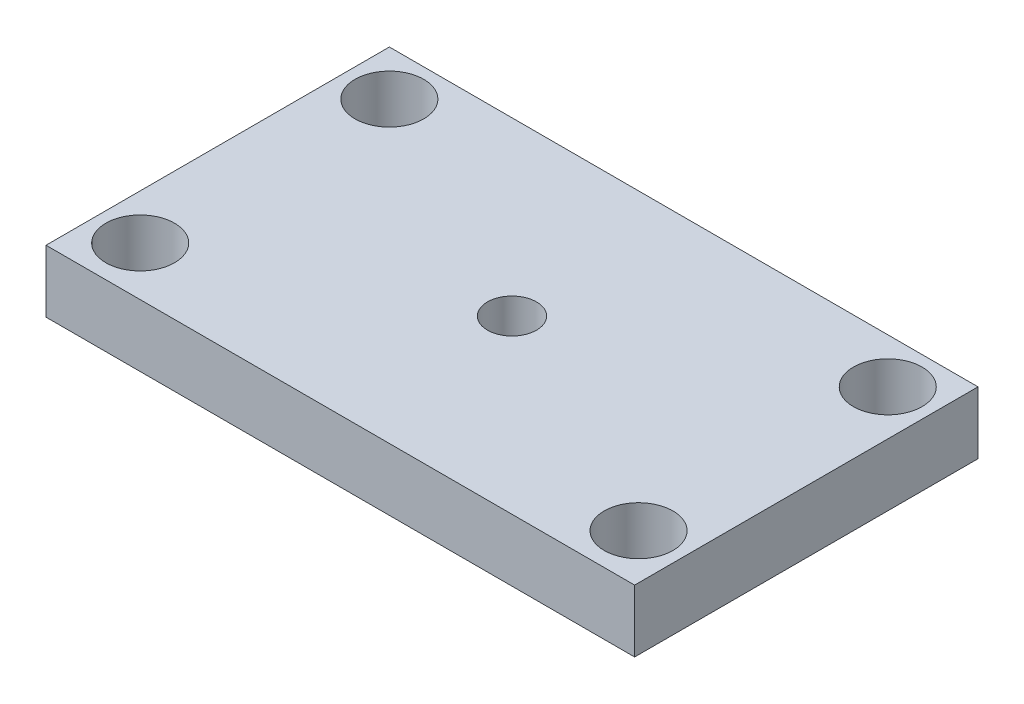
ISO-10303-21;
HEADER;
FILE_DESCRIPTION(('STEP AP214'),'2;1');
FILE_NAME('part.step','',(''),(''),'','','');
FILE_SCHEMA(('AUTOMOTIVE_DESIGN { 1 0 10303 214 1 1 1 1 }'));
ENDSEC;
DATA;
#1=APPLICATION_CONTEXT('core data for automotive mechanical design processes');
#2=APPLICATION_PROTOCOL_DEFINITION('international standard','automotive_design',2000,#1);
#3=PRODUCT_CONTEXT('',#1,'mechanical');
#4=PRODUCT('Part','Part','',(#3));
#5=PRODUCT_RELATED_PRODUCT_CATEGORY('part','',(#4));
#6=PRODUCT_DEFINITION_FORMATION('','',#4);
#7=PRODUCT_DEFINITION_CONTEXT('part definition',#1,'design');
#8=PRODUCT_DEFINITION('design','',#6,#7);
#9=PRODUCT_DEFINITION_SHAPE('','',#8);
#10=(LENGTH_UNIT() NAMED_UNIT(*) SI_UNIT(.MILLI.,.METRE.));
#11=(NAMED_UNIT(*) PLANE_ANGLE_UNIT() SI_UNIT($,.RADIAN.));
#12=(NAMED_UNIT(*) SI_UNIT($,.STERADIAN.) SOLID_ANGLE_UNIT());
#13=UNCERTAINTY_MEASURE_WITH_UNIT(LENGTH_MEASURE(1.E-05),#10,'distance_accuracy_value','');
#14=(GEOMETRIC_REPRESENTATION_CONTEXT(3) GLOBAL_UNCERTAINTY_ASSIGNED_CONTEXT((#13)) GLOBAL_UNIT_ASSIGNED_CONTEXT((#10,
#11,#12)) REPRESENTATION_CONTEXT('',''));
#15=CARTESIAN_POINT('',(0.,0.,0.));
#16=DIRECTION('',(0.,0.,1.));
#17=DIRECTION('',(1.,0.,0.));
#18=AXIS2_PLACEMENT_3D('',#15,#16,#17);
#19=CARTESIAN_POINT('',(0.,6.35,0.));
#20=DIRECTION('',(0.,-1.,0.));
#21=DIRECTION('',(0.,0.,-1.));
#22=AXIS2_PLACEMENT_3D('',#19,#20,#21);
#23=PLANE('',#22);
#24=DIRECTION('',(0.,0.,1.));
#25=VECTOR('',#24,1.);
#26=CARTESIAN_POINT('',(0.,6.35,0.));
#27=LINE('',#26,#25);
#28=CARTESIAN_POINT('',(0.,6.35,-35.));
#29=VERTEX_POINT('',#28);
#30=CARTESIAN_POINT('',(0.,6.35,0.));
#31=VERTEX_POINT('',#30);
#32=EDGE_CURVE('E96',#29,#31,#27,.T.);
#33=ORIENTED_EDGE('',*,*,#32,.T.);
#34=DIRECTION('',(1.,0.,0.));
#35=VECTOR('',#34,1.);
#36=CARTESIAN_POINT('',(0.,6.35,0.));
#37=LINE('',#36,#35);
#38=CARTESIAN_POINT('',(60.,6.35,0.));
#39=VERTEX_POINT('',#38);
#40=EDGE_CURVE('E91',#31,#39,#37,.T.);
#41=ORIENTED_EDGE('',*,*,#40,.T.);
#42=DIRECTION('',(0.,0.,-1.));
#43=VECTOR('',#42,1.);
#44=CARTESIAN_POINT('',(60.,6.35,0.));
#45=LINE('',#44,#43);
#46=CARTESIAN_POINT('',(60.,6.35,-35.));
#47=VERTEX_POINT('',#46);
#48=EDGE_CURVE('E94',#39,#47,#45,.T.);
#49=ORIENTED_EDGE('',*,*,#48,.T.);
#50=DIRECTION('',(-1.,0.,0.));
#51=VECTOR('',#50,1.);
#52=CARTESIAN_POINT('',(0.,6.35,-35.));
#53=LINE('',#52,#51);
#54=EDGE_CURVE('E61',#47,#29,#53,.T.);
#55=ORIENTED_EDGE('',*,*,#54,.T.);
#56=EDGE_LOOP('',(#33,#41,#49,#55));
#57=FACE_BOUND('',#56,.T.);
#58=CARTESIAN_POINT('',(4.6,6.35,-30.4));
#59=DIRECTION('',(0.,1.,0.));
#60=DIRECTION('',(0.,0.,1.));
#61=AXIS2_PLACEMENT_3D('',#58,#59,#60);
#62=CIRCLE('',#61,3.5);
#63=CARTESIAN_POINT('',(4.6,6.35,-26.9));
#64=VERTEX_POINT('',#63);
#65=EDGE_CURVE('E116',#64,#64,#62,.T.);
#66=ORIENTED_EDGE('',*,*,#65,.F.);
#67=EDGE_LOOP('',(#66));
#68=FACE_BOUND('',#67,.T.);
#69=CARTESIAN_POINT('',(55.4,6.35,-30.4));
#70=DIRECTION('',(0.,1.,0.));
#71=DIRECTION('',(0.,0.,1.));
#72=AXIS2_PLACEMENT_3D('',#69,#70,#71);
#73=CIRCLE('',#72,3.5);
#74=CARTESIAN_POINT('',(55.4,6.35,-26.9));
#75=VERTEX_POINT('',#74);
#76=EDGE_CURVE('E138',#75,#75,#73,.T.);
#77=ORIENTED_EDGE('',*,*,#76,.F.);
#78=EDGE_LOOP('',(#77));
#79=FACE_BOUND('',#78,.T.);
#80=CARTESIAN_POINT('',(4.6,6.35,-5.));
#81=DIRECTION('',(0.,1.,0.));
#82=DIRECTION('',(0.,0.,1.));
#83=AXIS2_PLACEMENT_3D('',#80,#81,#82);
#84=CIRCLE('',#83,3.5);
#85=CARTESIAN_POINT('',(4.6,6.35,-1.5));
#86=VERTEX_POINT('',#85);
#87=EDGE_CURVE('E146',#86,#86,#84,.T.);
#88=ORIENTED_EDGE('',*,*,#87,.F.);
#89=EDGE_LOOP('',(#88));
#90=FACE_BOUND('',#89,.T.);
#91=CARTESIAN_POINT('',(55.4,6.35,-5.));
#92=DIRECTION('',(0.,1.,0.));
#93=DIRECTION('',(0.,0.,1.));
#94=AXIS2_PLACEMENT_3D('',#91,#92,#93);
#95=CIRCLE('',#94,3.5);
#96=CARTESIAN_POINT('',(55.4,6.35,-1.5));
#97=VERTEX_POINT('',#96);
#98=EDGE_CURVE('E154',#97,#97,#95,.T.);
#99=ORIENTED_EDGE('',*,*,#98,.F.);
#100=EDGE_LOOP('',(#99));
#101=FACE_BOUND('',#100,.T.);
#102=CARTESIAN_POINT('',(30.,6.35,-17.5));
#103=DIRECTION('',(0.,1.,0.));
#104=DIRECTION('',(0.,0.,1.));
#105=AXIS2_PLACEMENT_3D('',#102,#103,#104);
#106=CIRCLE('',#105,2.5);
#107=CARTESIAN_POINT('',(30.,6.35,-15.));
#108=VERTEX_POINT('',#107);
#109=EDGE_CURVE('E162',#108,#108,#106,.T.);
#110=ORIENTED_EDGE('',*,*,#109,.F.);
#111=EDGE_LOOP('',(#110));
#112=FACE_BOUND('',#111,.T.);
#113=ADVANCED_FACE('F43',(#57,#68,#79,#90,#101,#112),#23,.F.);
#114=CARTESIAN_POINT('',(0.,0.,0.));
#115=DIRECTION('',(0.,-1.,0.));
#116=DIRECTION('',(0.,0.,-1.));
#117=AXIS2_PLACEMENT_3D('',#114,#115,#116);
#118=PLANE('',#117);
#119=CARTESIAN_POINT('',(55.4,0.,-5.));
#120=DIRECTION('',(0.,1.,0.));
#121=DIRECTION('',(0.,0.,1.));
#122=AXIS2_PLACEMENT_3D('',#119,#120,#121);
#123=CIRCLE('',#122,3.5);
#124=CARTESIAN_POINT('',(55.4,0.,-1.5));
#125=VERTEX_POINT('',#124);
#126=EDGE_CURVE('E158',#125,#125,#123,.T.);
#127=ORIENTED_EDGE('',*,*,#126,.T.);
#128=EDGE_LOOP('',(#127));
#129=FACE_BOUND('',#128,.T.);
#130=CARTESIAN_POINT('',(55.4,0.,-30.4));
#131=DIRECTION('',(0.,1.,0.));
#132=DIRECTION('',(0.,0.,1.));
#133=AXIS2_PLACEMENT_3D('',#130,#131,#132);
#134=CIRCLE('',#133,3.5);
#135=CARTESIAN_POINT('',(55.4,0.,-26.9));
#136=VERTEX_POINT('',#135);
#137=EDGE_CURVE('E142',#136,#136,#134,.T.);
#138=ORIENTED_EDGE('',*,*,#137,.T.);
#139=EDGE_LOOP('',(#138));
#140=FACE_BOUND('',#139,.T.);
#141=DIRECTION('',(0.,0.,1.));
#142=VECTOR('',#141,1.);
#143=CARTESIAN_POINT('',(0.,0.,0.));
#144=LINE('',#143,#142);
#145=CARTESIAN_POINT('',(0.,0.,-35.));
#146=VERTEX_POINT('',#145);
#147=CARTESIAN_POINT('',(0.,0.,0.));
#148=VERTEX_POINT('',#147);
#149=EDGE_CURVE('E112',#146,#148,#144,.T.);
#150=ORIENTED_EDGE('',*,*,#149,.F.);
#151=DIRECTION('',(-1.,0.,0.));
#152=VECTOR('',#151,1.);
#153=CARTESIAN_POINT('',(0.,0.,-35.));
#154=LINE('',#153,#152);
#155=CARTESIAN_POINT('',(60.,0.,-35.));
#156=VERTEX_POINT('',#155);
#157=EDGE_CURVE('E84',#156,#146,#154,.T.);
#158=ORIENTED_EDGE('',*,*,#157,.F.);
#159=DIRECTION('',(0.,0.,-1.));
#160=VECTOR('',#159,1.);
#161=CARTESIAN_POINT('',(60.,0.,0.));
#162=LINE('',#161,#160);
#163=CARTESIAN_POINT('',(60.,0.,0.));
#164=VERTEX_POINT('',#163);
#165=EDGE_CURVE('E78',#164,#156,#162,.T.);
#166=ORIENTED_EDGE('',*,*,#165,.F.);
#167=DIRECTION('',(1.,0.,0.));
#168=VECTOR('',#167,1.);
#169=CARTESIAN_POINT('',(0.,0.,0.));
#170=LINE('',#169,#168);
#171=EDGE_CURVE('E101',#148,#164,#170,.T.);
#172=ORIENTED_EDGE('',*,*,#171,.F.);
#173=EDGE_LOOP('',(#150,#158,#166,#172));
#174=FACE_BOUND('',#173,.T.);
#175=CARTESIAN_POINT('',(4.6,0.,-30.4));
#176=DIRECTION('',(0.,1.,0.));
#177=DIRECTION('',(0.,0.,1.));
#178=AXIS2_PLACEMENT_3D('',#175,#176,#177);
#179=CIRCLE('',#178,3.5);
#180=CARTESIAN_POINT('',(4.6,0.,-26.9));
#181=VERTEX_POINT('',#180);
#182=EDGE_CURVE('E134',#181,#181,#179,.T.);
#183=ORIENTED_EDGE('',*,*,#182,.T.);
#184=EDGE_LOOP('',(#183));
#185=FACE_BOUND('',#184,.T.);
#186=CARTESIAN_POINT('',(4.6,0.,-5.));
#187=DIRECTION('',(0.,1.,0.));
#188=DIRECTION('',(0.,0.,1.));
#189=AXIS2_PLACEMENT_3D('',#186,#187,#188);
#190=CIRCLE('',#189,3.5);
#191=CARTESIAN_POINT('',(4.6,0.,-1.5));
#192=VERTEX_POINT('',#191);
#193=EDGE_CURVE('E150',#192,#192,#190,.T.);
#194=ORIENTED_EDGE('',*,*,#193,.T.);
#195=EDGE_LOOP('',(#194));
#196=FACE_BOUND('',#195,.T.);
#197=CARTESIAN_POINT('',(30.,0.,-17.5));
#198=DIRECTION('',(0.,1.,0.));
#199=DIRECTION('',(0.,0.,1.));
#200=AXIS2_PLACEMENT_3D('',#197,#198,#199);
#201=CIRCLE('',#200,2.5);
#202=CARTESIAN_POINT('',(30.,0.,-15.));
#203=VERTEX_POINT('',#202);
#204=EDGE_CURVE('E166',#203,#203,#201,.T.);
#205=ORIENTED_EDGE('',*,*,#204,.T.);
#206=EDGE_LOOP('',(#205));
#207=FACE_BOUND('',#206,.T.);
#208=ADVANCED_FACE('F129',(#129,#140,#174,#185,#196,#207),#118,.T.);
#209=CARTESIAN_POINT('',(0.,6.35,0.));
#210=DIRECTION('',(1.,0.,0.));
#211=DIRECTION('',(0.,0.,-1.));
#212=AXIS2_PLACEMENT_3D('',#209,#210,#211);
#213=PLANE('',#212);
#214=ORIENTED_EDGE('',*,*,#149,.T.);
#215=DIRECTION('',(0.,-1.,0.));
#216=VECTOR('',#215,1.);
#217=CARTESIAN_POINT('',(0.,6.35,0.));
#218=LINE('',#217,#216);
#219=EDGE_CURVE('E11',#31,#148,#218,.T.);
#220=ORIENTED_EDGE('',*,*,#219,.F.);
#221=ORIENTED_EDGE('',*,*,#32,.F.);
#222=DIRECTION('',(0.,-1.,0.));
#223=VECTOR('',#222,1.);
#224=CARTESIAN_POINT('',(0.,6.35,-35.));
#225=LINE('',#224,#223);
#226=EDGE_CURVE('E108',#29,#146,#225,.T.);
#227=ORIENTED_EDGE('',*,*,#226,.T.);
#228=EDGE_LOOP('',(#214,#220,#221,#227));
#229=FACE_BOUND('',#228,.T.);
#230=ADVANCED_FACE('F45',(#229),#213,.F.);
#231=CARTESIAN_POINT('',(0.,6.35,0.));
#232=DIRECTION('',(0.,0.,-1.));
#233=DIRECTION('',(-1.,0.,0.));
#234=AXIS2_PLACEMENT_3D('',#231,#232,#233);
#235=PLANE('',#234);
#236=ORIENTED_EDGE('',*,*,#171,.T.);
#237=DIRECTION('',(0.,-1.,0.));
#238=VECTOR('',#237,1.);
#239=CARTESIAN_POINT('',(60.,6.35,0.));
#240=LINE('',#239,#238);
#241=EDGE_CURVE('E53',#39,#164,#240,.T.);
#242=ORIENTED_EDGE('',*,*,#241,.F.);
#243=ORIENTED_EDGE('',*,*,#40,.F.);
#244=ORIENTED_EDGE('',*,*,#219,.T.);
#245=EDGE_LOOP('',(#236,#242,#243,#244));
#246=FACE_BOUND('',#245,.T.);
#247=ADVANCED_FACE('F100',(#246),#235,.F.);
#248=CARTESIAN_POINT('',(60.,6.35,0.));
#249=DIRECTION('',(-1.,0.,0.));
#250=DIRECTION('',(0.,0.,1.));
#251=AXIS2_PLACEMENT_3D('',#248,#249,#250);
#252=PLANE('',#251);
#253=ORIENTED_EDGE('',*,*,#165,.T.);
#254=DIRECTION('',(0.,-1.,0.));
#255=VECTOR('',#254,1.);
#256=CARTESIAN_POINT('',(60.,6.35,-35.));
#257=LINE('',#256,#255);
#258=EDGE_CURVE('E103',#47,#156,#257,.T.);
#259=ORIENTED_EDGE('',*,*,#258,.F.);
#260=ORIENTED_EDGE('',*,*,#48,.F.);
#261=ORIENTED_EDGE('',*,*,#241,.T.);
#262=EDGE_LOOP('',(#253,#259,#260,#261));
#263=FACE_BOUND('',#262,.T.);
#264=ADVANCED_FACE('F104',(#263),#252,.F.);
#265=CARTESIAN_POINT('',(0.,6.35,-35.));
#266=DIRECTION('',(0.,0.,1.));
#267=DIRECTION('',(1.,0.,0.));
#268=AXIS2_PLACEMENT_3D('',#265,#266,#267);
#269=PLANE('',#268);
#270=ORIENTED_EDGE('',*,*,#157,.T.);
#271=ORIENTED_EDGE('',*,*,#226,.F.);
#272=ORIENTED_EDGE('',*,*,#54,.F.);
#273=ORIENTED_EDGE('',*,*,#258,.T.);
#274=EDGE_LOOP('',(#270,#271,#272,#273));
#275=FACE_BOUND('',#274,.T.);
#276=ADVANCED_FACE('F126',(#275),#269,.F.);
#277=CARTESIAN_POINT('',(4.6,6.35,-30.4));
#278=DIRECTION('',(0.,-1.,0.));
#279=DIRECTION('',(0.,0.,-1.));
#280=AXIS2_PLACEMENT_3D('',#277,#278,#279);
#281=CYLINDRICAL_SURFACE('',#280,3.5);
#282=ORIENTED_EDGE('',*,*,#65,.T.);
#283=EDGE_LOOP('',(#282));
#284=FACE_BOUND('',#283,.T.);
#285=ORIENTED_EDGE('',*,*,#182,.F.);
#286=EDGE_LOOP('',(#285));
#287=FACE_BOUND('',#286,.T.);
#288=ADVANCED_FACE('F185',(#284,#287),#281,.F.);
#289=CARTESIAN_POINT('',(55.4,6.35,-30.4));
#290=DIRECTION('',(0.,-1.,0.));
#291=DIRECTION('',(0.,0.,-1.));
#292=AXIS2_PLACEMENT_3D('',#289,#290,#291);
#293=CYLINDRICAL_SURFACE('',#292,3.5);
#294=ORIENTED_EDGE('',*,*,#76,.T.);
#295=EDGE_LOOP('',(#294));
#296=FACE_BOUND('',#295,.T.);
#297=ORIENTED_EDGE('',*,*,#137,.F.);
#298=EDGE_LOOP('',(#297));
#299=FACE_BOUND('',#298,.T.);
#300=ADVANCED_FACE('F239',(#296,#299),#293,.F.);
#301=CARTESIAN_POINT('',(4.6,6.35,-5.));
#302=DIRECTION('',(0.,-1.,0.));
#303=DIRECTION('',(0.,0.,-1.));
#304=AXIS2_PLACEMENT_3D('',#301,#302,#303);
#305=CYLINDRICAL_SURFACE('',#304,3.5);
#306=ORIENTED_EDGE('',*,*,#87,.T.);
#307=EDGE_LOOP('',(#306));
#308=FACE_BOUND('',#307,.T.);
#309=ORIENTED_EDGE('',*,*,#193,.F.);
#310=EDGE_LOOP('',(#309));
#311=FACE_BOUND('',#310,.T.);
#312=ADVANCED_FACE('F248',(#308,#311),#305,.F.);
#313=CARTESIAN_POINT('',(55.4,6.35,-5.));
#314=DIRECTION('',(0.,-1.,0.));
#315=DIRECTION('',(0.,0.,-1.));
#316=AXIS2_PLACEMENT_3D('',#313,#314,#315);
#317=CYLINDRICAL_SURFACE('',#316,3.5);
#318=ORIENTED_EDGE('',*,*,#98,.T.);
#319=EDGE_LOOP('',(#318));
#320=FACE_BOUND('',#319,.T.);
#321=ORIENTED_EDGE('',*,*,#126,.F.);
#322=EDGE_LOOP('',(#321));
#323=FACE_BOUND('',#322,.T.);
#324=ADVANCED_FACE('F257',(#320,#323),#317,.F.);
#325=CARTESIAN_POINT('',(30.,6.35,-17.5));
#326=DIRECTION('',(0.,-1.,0.));
#327=DIRECTION('',(0.,0.,-1.));
#328=AXIS2_PLACEMENT_3D('',#325,#326,#327);
#329=CYLINDRICAL_SURFACE('',#328,2.5);
#330=ORIENTED_EDGE('',*,*,#109,.T.);
#331=EDGE_LOOP('',(#330));
#332=FACE_BOUND('',#331,.T.);
#333=ORIENTED_EDGE('',*,*,#204,.F.);
#334=EDGE_LOOP('',(#333));
#335=FACE_BOUND('',#334,.T.);
#336=ADVANCED_FACE('F174',(#332,#335),#329,.F.);
#337=CLOSED_SHELL('',(#113,#208,#230,#247,#264,#276,#288,#300,#312,#324,#336));
#338=MANIFOLD_SOLID_BREP('B2',#337);
#339=ADVANCED_BREP_SHAPE_REPRESENTATION('',(#18,#338),#14);
#340=SHAPE_DEFINITION_REPRESENTATION(#9,#339);
ENDSEC;
END-ISO-10303-21;
